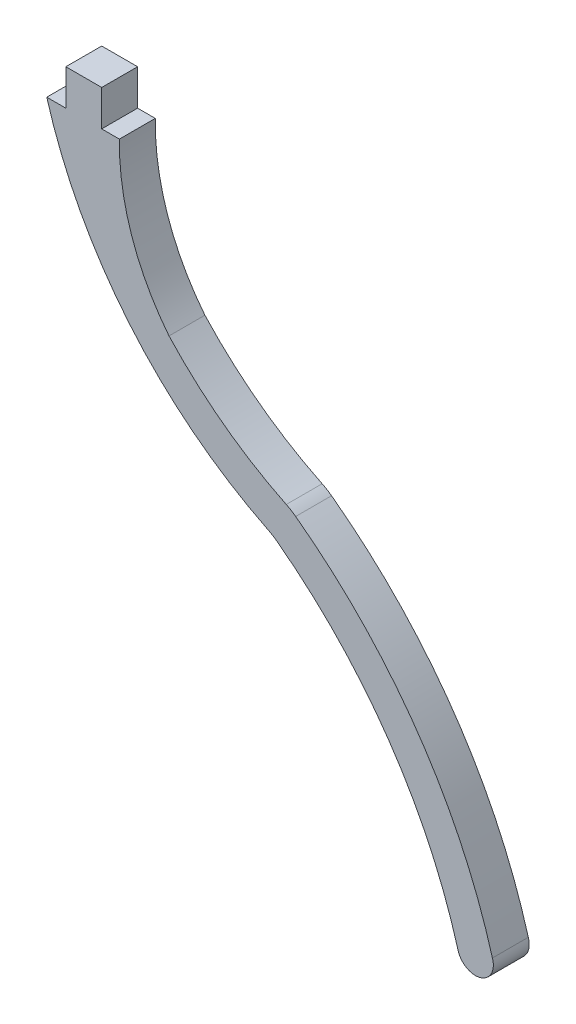
ISO-10303-21;
HEADER;
FILE_DESCRIPTION(('STEP AP214'),'2;1');
FILE_NAME('part.step','',(''),(''),'','','');
FILE_SCHEMA(('AUTOMOTIVE_DESIGN { 1 0 10303 214 1 1 1 1 }'));
ENDSEC;
DATA;
#1=APPLICATION_CONTEXT('core data for automotive mechanical design processes');
#2=APPLICATION_PROTOCOL_DEFINITION('international standard','automotive_design',2000,#1);
#3=PRODUCT_CONTEXT('',#1,'mechanical');
#4=PRODUCT('Part','Part','',(#3));
#5=PRODUCT_RELATED_PRODUCT_CATEGORY('part','',(#4));
#6=PRODUCT_DEFINITION_FORMATION('','',#4);
#7=PRODUCT_DEFINITION_CONTEXT('part definition',#1,'design');
#8=PRODUCT_DEFINITION('design','',#6,#7);
#9=PRODUCT_DEFINITION_SHAPE('','',#8);
#10=(LENGTH_UNIT() NAMED_UNIT(*) SI_UNIT(.MILLI.,.METRE.));
#11=(NAMED_UNIT(*) PLANE_ANGLE_UNIT() SI_UNIT($,.RADIAN.));
#12=(NAMED_UNIT(*) SI_UNIT($,.STERADIAN.) SOLID_ANGLE_UNIT());
#13=UNCERTAINTY_MEASURE_WITH_UNIT(LENGTH_MEASURE(1.E-05),#10,'distance_accuracy_value','');
#14=(GEOMETRIC_REPRESENTATION_CONTEXT(3) GLOBAL_UNCERTAINTY_ASSIGNED_CONTEXT((#13)) GLOBAL_UNIT_ASSIGNED_CONTEXT((#10,
#11,#12)) REPRESENTATION_CONTEXT('',''));
#15=CARTESIAN_POINT('',(0.,0.,0.));
#16=DIRECTION('',(0.,0.,1.));
#17=DIRECTION('',(1.,0.,0.));
#18=AXIS2_PLACEMENT_3D('',#15,#16,#17);
#19=CARTESIAN_POINT('',(11.455226844423,-12.1774036241141,1.524));
#20=DIRECTION('',(0.,0.,-1.));
#21=DIRECTION('',(-1.,0.,0.));
#22=AXIS2_PLACEMENT_3D('',#19,#20,#21);
#23=CYLINDRICAL_SURFACE('',#22,2.54);
#24=CARTESIAN_POINT('',(11.455226844423,-12.1774036241141,0.));
#25=DIRECTION('',(0.,0.,1.));
#26=DIRECTION('',(1.,0.,0.));
#27=AXIS2_PLACEMENT_3D('',#24,#25,#26);
#28=CIRCLE('',#27,2.54);
#29=CARTESIAN_POINT('',(12.5663048739761,-9.89330519973653,0.));
#30=VERTEX_POINT('',#29);
#31=CARTESIAN_POINT('',(12.9652019085972,-10.1349601596402,0.));
#32=VERTEX_POINT('',#31);
#33=EDGE_CURVE('E157',#30,#32,#28,.F.);
#34=ORIENTED_EDGE('',*,*,#33,.F.);
#35=DIRECTION('',(0.,0.,-1.));
#36=VECTOR('',#35,1.);
#37=CARTESIAN_POINT('',(12.5663048739761,-9.89330519973653,1.524));
#38=LINE('',#37,#36);
#39=CARTESIAN_POINT('',(12.5663048739761,-9.89330519973653,1.524));
#40=VERTEX_POINT('',#39);
#41=EDGE_CURVE('E11',#40,#30,#38,.T.);
#42=ORIENTED_EDGE('',*,*,#41,.F.);
#43=CARTESIAN_POINT('',(11.455226844423,-12.1774036241141,1.524));
#44=DIRECTION('',(0.,0.,1.));
#45=DIRECTION('',(1.,0.,0.));
#46=AXIS2_PLACEMENT_3D('',#43,#44,#45);
#47=CIRCLE('',#46,2.54);
#48=CARTESIAN_POINT('',(12.9652019085972,-10.1349601596402,1.524));
#49=VERTEX_POINT('',#48);
#50=EDGE_CURVE('E189',#40,#49,#47,.F.);
#51=ORIENTED_EDGE('',*,*,#50,.T.);
#52=DIRECTION('',(0.,0.,-1.));
#53=VECTOR('',#52,1.);
#54=CARTESIAN_POINT('',(12.9652019085972,-10.1349601596402,1.524));
#55=LINE('',#54,#53);
#56=EDGE_CURVE('E50',#49,#32,#55,.T.);
#57=ORIENTED_EDGE('',*,*,#56,.T.);
#58=EDGE_LOOP('',(#34,#42,#51,#57));
#59=FACE_BOUND('',#58,.T.);
#60=ADVANCED_FACE('F34',(#59),#23,.T.);
#61=CARTESIAN_POINT('',(19.8543390121188,5.08906943909652,1.524));
#62=DIRECTION('',(0.,0.,-1.));
#63=DIRECTION('',(-1.,0.,0.));
#64=AXIS2_PLACEMENT_3D('',#61,#62,#63);
#65=CYLINDRICAL_SURFACE('',#64,16.6609420927234);
#66=CARTESIAN_POINT('',(19.8543390121188,5.08906943909652,0.));
#67=DIRECTION('',(0.,0.,1.));
#68=DIRECTION('',(1.,0.,0.));
#69=AXIS2_PLACEMENT_3D('',#66,#67,#68);
#70=CIRCLE('',#69,16.6609420927234);
#71=CARTESIAN_POINT('',(7.58765753171491,-6.18548229812995,0.));
#72=VERTEX_POINT('',#71);
#73=EDGE_CURVE('E159',#72,#30,#70,.T.);
#74=ORIENTED_EDGE('',*,*,#73,.F.);
#75=DIRECTION('',(0.,0.,-1.));
#76=VECTOR('',#75,1.);
#77=CARTESIAN_POINT('',(7.58765753171491,-6.18548229812995,1.524));
#78=LINE('',#77,#76);
#79=CARTESIAN_POINT('',(7.58765753171491,-6.18548229812995,1.524));
#80=VERTEX_POINT('',#79);
#81=EDGE_CURVE('E42',#80,#72,#78,.T.);
#82=ORIENTED_EDGE('',*,*,#81,.F.);
#83=CARTESIAN_POINT('',(19.8543390121188,5.08906943909652,1.524));
#84=DIRECTION('',(0.,0.,1.));
#85=DIRECTION('',(1.,0.,0.));
#86=AXIS2_PLACEMENT_3D('',#83,#84,#85);
#87=CIRCLE('',#86,16.6609420927234);
#88=EDGE_CURVE('E230',#80,#40,#87,.T.);
#89=ORIENTED_EDGE('',*,*,#88,.T.);
#90=ORIENTED_EDGE('',*,*,#41,.T.);
#91=EDGE_LOOP('',(#74,#82,#89,#90));
#92=FACE_BOUND('',#91,.T.);
#93=ADVANCED_FACE('F218',(#92),#65,.F.);
#94=CARTESIAN_POINT('',(15.1604983598982,-0.153902537534086,1.524));
#95=DIRECTION('',(0.,0.,-1.));
#96=DIRECTION('',(-1.,0.,0.));
#97=AXIS2_PLACEMENT_3D('',#94,#95,#96);
#98=CYLINDRICAL_SURFACE('',#97,9.68131564496423);
#99=CARTESIAN_POINT('',(15.1604983598982,-0.153902537534086,0.));
#100=DIRECTION('',(0.,0.,1.));
#101=DIRECTION('',(1.,0.,0.));
#102=AXIS2_PLACEMENT_3D('',#99,#100,#101);
#103=CIRCLE('',#102,9.68131564496423);
#104=CARTESIAN_POINT('',(5.48040607591815,0.,0.));
#105=VERTEX_POINT('',#104);
#106=EDGE_CURVE('E162',#105,#72,#103,.T.);
#107=ORIENTED_EDGE('',*,*,#106,.F.);
#108=DIRECTION('',(0.,0.,-1.));
#109=VECTOR('',#108,1.);
#110=CARTESIAN_POINT('',(5.48040607591815,0.,1.524));
#111=LINE('',#110,#109);
#112=CARTESIAN_POINT('',(5.48040607591815,0.,1.524));
#113=VERTEX_POINT('',#112);
#114=EDGE_CURVE('E207',#113,#105,#111,.T.);
#115=ORIENTED_EDGE('',*,*,#114,.F.);
#116=CARTESIAN_POINT('',(15.1604983598982,-0.153902537534086,1.524));
#117=DIRECTION('',(0.,0.,1.));
#118=DIRECTION('',(1.,0.,0.));
#119=AXIS2_PLACEMENT_3D('',#116,#117,#118);
#120=CIRCLE('',#119,9.68131564496423);
#121=EDGE_CURVE('E214',#113,#80,#120,.T.);
#122=ORIENTED_EDGE('',*,*,#121,.T.);
#123=ORIENTED_EDGE('',*,*,#81,.T.);
#124=EDGE_LOOP('',(#107,#115,#122,#123));
#125=FACE_BOUND('',#124,.T.);
#126=ADVANCED_FACE('F212',(#125),#98,.F.);
#127=CARTESIAN_POINT('',(0.,0.,1.524));
#128=DIRECTION('',(0.,1.,0.));
#129=DIRECTION('',(-1.,0.,0.));
#130=AXIS2_PLACEMENT_3D('',#127,#128,#129);
#131=PLANE('',#130);
#132=DIRECTION('',(1.,0.,0.));
#133=VECTOR('',#132,1.);
#134=CARTESIAN_POINT('',(0.,0.,0.));
#135=LINE('',#134,#133);
#136=CARTESIAN_POINT('',(4.72954689049709,0.,0.));
#137=VERTEX_POINT('',#136);
#138=EDGE_CURVE('E165',#137,#105,#135,.T.);
#139=ORIENTED_EDGE('',*,*,#138,.F.);
#140=DIRECTION('',(0.,0.,-1.));
#141=VECTOR('',#140,1.);
#142=CARTESIAN_POINT('',(4.72954689049709,0.,1.524));
#143=LINE('',#142,#141);
#144=CARTESIAN_POINT('',(4.72954689049709,0.,1.524));
#145=VERTEX_POINT('',#144);
#146=EDGE_CURVE('E205',#145,#137,#143,.T.);
#147=ORIENTED_EDGE('',*,*,#146,.F.);
#148=DIRECTION('',(1.,0.,0.));
#149=VECTOR('',#148,1.);
#150=CARTESIAN_POINT('',(0.,0.,1.524));
#151=LINE('',#150,#149);
#152=EDGE_CURVE('E227',#145,#113,#151,.T.);
#153=ORIENTED_EDGE('',*,*,#152,.T.);
#154=ORIENTED_EDGE('',*,*,#114,.T.);
#155=EDGE_LOOP('',(#139,#147,#153,#154));
#156=FACE_BOUND('',#155,.T.);
#157=ADVANCED_FACE('F224',(#156),#131,.T.);
#158=CARTESIAN_POINT('',(4.72954689049709,0.,1.524));
#159=DIRECTION('',(1.,0.,0.));
#160=DIRECTION('',(0.,0.,-1.));
#161=AXIS2_PLACEMENT_3D('',#158,#159,#160);
#162=PLANE('',#161);
#163=DIRECTION('',(0.,-1.,0.));
#164=VECTOR('',#163,1.);
#165=CARTESIAN_POINT('',(4.72954689049709,0.,0.));
#166=LINE('',#165,#164);
#167=CARTESIAN_POINT('',(4.72954689049709,1.52399999999999,0.));
#168=VERTEX_POINT('',#167);
#169=EDGE_CURVE('E168',#168,#137,#166,.T.);
#170=ORIENTED_EDGE('',*,*,#169,.F.);
#171=DIRECTION('',(0.,0.,-1.));
#172=VECTOR('',#171,1.);
#173=CARTESIAN_POINT('',(4.72954689049709,1.52399999999999,1.524));
#174=LINE('',#173,#172);
#175=CARTESIAN_POINT('',(4.72954689049709,1.52399999999999,1.524));
#176=VERTEX_POINT('',#175);
#177=EDGE_CURVE('E203',#176,#168,#174,.T.);
#178=ORIENTED_EDGE('',*,*,#177,.F.);
#179=DIRECTION('',(0.,-1.,0.));
#180=VECTOR('',#179,1.);
#181=CARTESIAN_POINT('',(4.72954689049709,0.,1.524));
#182=LINE('',#181,#180);
#183=EDGE_CURVE('E232',#176,#145,#182,.T.);
#184=ORIENTED_EDGE('',*,*,#183,.T.);
#185=ORIENTED_EDGE('',*,*,#146,.T.);
#186=EDGE_LOOP('',(#170,#178,#184,#185));
#187=FACE_BOUND('',#186,.T.);
#188=ADVANCED_FACE('F279',(#187),#162,.T.);
#189=CARTESIAN_POINT('',(0.,1.52399999999999,1.524));
#190=DIRECTION('',(0.,1.,0.));
#191=DIRECTION('',(0.,0.,1.));
#192=AXIS2_PLACEMENT_3D('',#189,#190,#191);
#193=PLANE('',#192);
#194=DIRECTION('',(1.,0.,0.));
#195=VECTOR('',#194,1.);
#196=CARTESIAN_POINT('',(0.,1.52399999999999,0.));
#197=LINE('',#196,#195);
#198=CARTESIAN_POINT('',(3.20554689049709,1.52399999999999,0.));
#199=VERTEX_POINT('',#198);
#200=EDGE_CURVE('E171',#199,#168,#197,.T.);
#201=ORIENTED_EDGE('',*,*,#200,.F.);
#202=DIRECTION('',(0.,0.,-1.));
#203=VECTOR('',#202,1.);
#204=CARTESIAN_POINT('',(3.20554689049709,1.52399999999999,1.524));
#205=LINE('',#204,#203);
#206=CARTESIAN_POINT('',(3.20554689049709,1.52399999999999,1.524));
#207=VERTEX_POINT('',#206);
#208=EDGE_CURVE('E201',#207,#199,#205,.T.);
#209=ORIENTED_EDGE('',*,*,#208,.F.);
#210=DIRECTION('',(1.,0.,0.));
#211=VECTOR('',#210,1.);
#212=CARTESIAN_POINT('',(0.,1.52399999999999,1.524));
#213=LINE('',#212,#211);
#214=EDGE_CURVE('E238',#207,#176,#213,.T.);
#215=ORIENTED_EDGE('',*,*,#214,.T.);
#216=ORIENTED_EDGE('',*,*,#177,.T.);
#217=EDGE_LOOP('',(#201,#209,#215,#216));
#218=FACE_BOUND('',#217,.T.);
#219=ADVANCED_FACE('F282',(#218),#193,.T.);
#220=CARTESIAN_POINT('',(3.20554689049709,0.,1.524));
#221=DIRECTION('',(-1.,0.,0.));
#222=DIRECTION('',(0.,0.,1.));
#223=AXIS2_PLACEMENT_3D('',#220,#221,#222);
#224=PLANE('',#223);
#225=DIRECTION('',(0.,1.,0.));
#226=VECTOR('',#225,1.);
#227=CARTESIAN_POINT('',(3.20554689049709,0.,0.));
#228=LINE('',#227,#226);
#229=CARTESIAN_POINT('',(3.20554689049709,0.,0.));
#230=VERTEX_POINT('',#229);
#231=EDGE_CURVE('E174',#230,#199,#228,.T.);
#232=ORIENTED_EDGE('',*,*,#231,.F.);
#233=DIRECTION('',(0.,0.,-1.));
#234=VECTOR('',#233,1.);
#235=CARTESIAN_POINT('',(3.20554689049709,0.,1.524));
#236=LINE('',#235,#234);
#237=CARTESIAN_POINT('',(3.20554689049709,0.,1.524));
#238=VERTEX_POINT('',#237);
#239=EDGE_CURVE('E199',#238,#230,#236,.T.);
#240=ORIENTED_EDGE('',*,*,#239,.F.);
#241=DIRECTION('',(0.,1.,0.));
#242=VECTOR('',#241,1.);
#243=CARTESIAN_POINT('',(3.20554689049709,0.,1.524));
#244=LINE('',#243,#242);
#245=EDGE_CURVE('E241',#238,#207,#244,.T.);
#246=ORIENTED_EDGE('',*,*,#245,.T.);
#247=ORIENTED_EDGE('',*,*,#208,.T.);
#248=EDGE_LOOP('',(#232,#240,#246,#247));
#249=FACE_BOUND('',#248,.T.);
#250=ADVANCED_FACE('F286',(#249),#224,.T.);
#251=CARTESIAN_POINT('',(0.,0.,1.524));
#252=DIRECTION('',(0.,-1.,0.));
#253=DIRECTION('',(1.,0.,0.));
#254=AXIS2_PLACEMENT_3D('',#251,#252,#253);
#255=PLANE('',#254);
#256=DIRECTION('',(-1.,0.,0.));
#257=VECTOR('',#256,1.);
#258=CARTESIAN_POINT('',(0.,0.,0.));
#259=LINE('',#258,#257);
#260=CARTESIAN_POINT('',(2.39600314755961,0.,0.));
#261=VERTEX_POINT('',#260);
#262=EDGE_CURVE('E177',#230,#261,#259,.T.);
#263=ORIENTED_EDGE('',*,*,#262,.T.);
#264=DIRECTION('',(0.,0.,-1.));
#265=VECTOR('',#264,1.);
#266=CARTESIAN_POINT('',(2.39600314755961,0.,1.524));
#267=LINE('',#266,#265);
#268=CARTESIAN_POINT('',(2.39600314755961,0.,1.524));
#269=VERTEX_POINT('',#268);
#270=EDGE_CURVE('E196',#269,#261,#267,.T.);
#271=ORIENTED_EDGE('',*,*,#270,.F.);
#272=DIRECTION('',(-1.,0.,0.));
#273=VECTOR('',#272,1.);
#274=CARTESIAN_POINT('',(0.,0.,1.524));
#275=LINE('',#274,#273);
#276=EDGE_CURVE('E244',#238,#269,#275,.T.);
#277=ORIENTED_EDGE('',*,*,#276,.F.);
#278=ORIENTED_EDGE('',*,*,#239,.T.);
#279=EDGE_LOOP('',(#263,#271,#277,#278));
#280=FACE_BOUND('',#279,.T.);
#281=ADVANCED_FACE('F290',(#280),#255,.F.);
#282=CARTESIAN_POINT('',(19.8543390121188,5.08906943909652,1.524));
#283=DIRECTION('',(0.,0.,-1.));
#284=DIRECTION('',(-1.,0.,0.));
#285=AXIS2_PLACEMENT_3D('',#282,#283,#284);
#286=CYLINDRICAL_SURFACE('',#285,18.1849420927234);
#287=CARTESIAN_POINT('',(19.8543390121188,5.08906943909652,0.));
#288=DIRECTION('',(0.,0.,1.));
#289=DIRECTION('',(1.,0.,0.));
#290=AXIS2_PLACEMENT_3D('',#287,#288,#289);
#291=CIRCLE('',#290,18.1849420927234);
#292=CARTESIAN_POINT('',(11.7847006981072,-11.2073429389926,0.));
#293=VERTEX_POINT('',#292);
#294=EDGE_CURVE('E179',#261,#293,#291,.T.);
#295=ORIENTED_EDGE('',*,*,#294,.T.);
#296=DIRECTION('',(0.,0.,-1.));
#297=VECTOR('',#296,1.);
#298=CARTESIAN_POINT('',(11.7847006981072,-11.2073429389926,1.524));
#299=LINE('',#298,#297);
#300=CARTESIAN_POINT('',(11.7847006981072,-11.2073429389926,1.524));
#301=VERTEX_POINT('',#300);
#302=EDGE_CURVE('E193',#301,#293,#299,.T.);
#303=ORIENTED_EDGE('',*,*,#302,.F.);
#304=CARTESIAN_POINT('',(19.8543390121188,5.08906943909652,1.524));
#305=DIRECTION('',(0.,0.,1.));
#306=DIRECTION('',(1.,0.,0.));
#307=AXIS2_PLACEMENT_3D('',#304,#305,#306);
#308=CIRCLE('',#307,18.1849420927234);
#309=EDGE_CURVE('E246',#269,#301,#308,.T.);
#310=ORIENTED_EDGE('',*,*,#309,.F.);
#311=ORIENTED_EDGE('',*,*,#270,.T.);
#312=EDGE_LOOP('',(#295,#303,#310,#311));
#313=FACE_BOUND('',#312,.T.);
#314=ADVANCED_FACE('F253',(#313),#286,.T.);
#315=CARTESIAN_POINT('',(10.6575658844203,-13.4835606596369,1.524));
#316=DIRECTION('',(0.,0.,-1.));
#317=DIRECTION('',(-1.,0.,0.));
#318=AXIS2_PLACEMENT_3D('',#315,#316,#317);
#319=CYLINDRICAL_SURFACE('',#318,2.54);
#320=CARTESIAN_POINT('',(10.6575658844203,-13.4835606596369,0.));
#321=DIRECTION('',(0.,0.,1.));
#322=DIRECTION('',(1.,0.,0.));
#323=AXIS2_PLACEMENT_3D('',#320,#321,#322);
#324=CIRCLE('',#323,2.54);
#325=CARTESIAN_POINT('',(12.1822657890628,-11.4520857765081,0.));
#326=VERTEX_POINT('',#325);
#327=EDGE_CURVE('E181',#293,#326,#324,.F.);
#328=ORIENTED_EDGE('',*,*,#327,.T.);
#329=DIRECTION('',(0.,0.,-1.));
#330=VECTOR('',#329,1.);
#331=CARTESIAN_POINT('',(12.1822657890628,-11.4520857765081,1.524));
#332=LINE('',#331,#330);
#333=CARTESIAN_POINT('',(12.1822657890628,-11.4520857765081,1.524));
#334=VERTEX_POINT('',#333);
#335=EDGE_CURVE('E149',#334,#326,#332,.T.);
#336=ORIENTED_EDGE('',*,*,#335,.F.);
#337=CARTESIAN_POINT('',(10.6575658844203,-13.4835606596369,1.524));
#338=DIRECTION('',(0.,0.,1.));
#339=DIRECTION('',(1.,0.,0.));
#340=AXIS2_PLACEMENT_3D('',#337,#338,#339);
#341=CIRCLE('',#340,2.54);
#342=EDGE_CURVE('E137',#301,#334,#341,.F.);
#343=ORIENTED_EDGE('',*,*,#342,.F.);
#344=ORIENTED_EDGE('',*,*,#302,.T.);
#345=EDGE_LOOP('',(#328,#336,#343,#344));
#346=FACE_BOUND('',#345,.T.);
#347=ADVANCED_FACE('F257',(#346),#319,.F.);
#348=CARTESIAN_POINT('',(-0.558970723708179,-28.4282145720071,1.524));
#349=DIRECTION('',(0.,0.,-1.));
#350=DIRECTION('',(-1.,0.,0.));
#351=AXIS2_PLACEMENT_3D('',#348,#349,#350);
#352=CYLINDRICAL_SURFACE('',#351,21.2256462034902);
#353=CARTESIAN_POINT('',(-0.558970723708179,-28.4282145720071,0.));
#354=DIRECTION('',(0.,0.,1.));
#355=DIRECTION('',(1.,0.,0.));
#356=AXIS2_PLACEMENT_3D('',#353,#354,#355);
#357=CIRCLE('',#356,21.2256462034902);
#358=CARTESIAN_POINT('',(19.8543390121188,-22.6123017128828,0.));
#359=VERTEX_POINT('',#358);
#360=EDGE_CURVE('E146',#326,#359,#357,.F.);
#361=ORIENTED_EDGE('',*,*,#360,.T.);
#362=DIRECTION('',(0.,0.,-1.));
#363=VECTOR('',#362,1.);
#364=CARTESIAN_POINT('',(19.8543390121188,-22.6123017128828,1.524));
#365=LINE('',#364,#363);
#366=CARTESIAN_POINT('',(19.8543390121188,-22.6123017128828,1.524));
#367=VERTEX_POINT('',#366);
#368=EDGE_CURVE('E143',#367,#359,#365,.T.);
#369=ORIENTED_EDGE('',*,*,#368,.F.);
#370=CARTESIAN_POINT('',(-0.558970723708179,-28.4282145720071,1.524));
#371=DIRECTION('',(0.,0.,1.));
#372=DIRECTION('',(1.,0.,0.));
#373=AXIS2_PLACEMENT_3D('',#370,#371,#372);
#374=CIRCLE('',#373,21.2256462034902);
#375=EDGE_CURVE('E130',#334,#367,#374,.F.);
#376=ORIENTED_EDGE('',*,*,#375,.F.);
#377=ORIENTED_EDGE('',*,*,#335,.T.);
#378=EDGE_LOOP('',(#361,#369,#376,#377));
#379=FACE_BOUND('',#378,.T.);
#380=ADVANCED_FACE('F144',(#379),#352,.F.);
#381=CARTESIAN_POINT('',(20.5975354347785,-22.4398707186363,1.524));
#382=DIRECTION('',(0.,0.,-1.));
#383=DIRECTION('',(-1.,0.,0.));
#384=AXIS2_PLACEMENT_3D('',#381,#382,#383);
#385=CYLINDRICAL_SURFACE('',#384,0.762937330605154);
#386=CARTESIAN_POINT('',(20.5975354347785,-22.4398707186363,0.));
#387=DIRECTION('',(0.,0.,1.));
#388=DIRECTION('',(1.,0.,0.));
#389=AXIS2_PLACEMENT_3D('',#386,#387,#388);
#390=CIRCLE('',#389,0.762937330605154);
#391=CARTESIAN_POINT('',(21.3200133072216,-22.1947195524938,0.));
#392=VERTEX_POINT('',#391);
#393=EDGE_CURVE('E184',#392,#359,#390,.F.);
#394=ORIENTED_EDGE('',*,*,#393,.F.);
#395=DIRECTION('',(0.,0.,-1.));
#396=VECTOR('',#395,1.);
#397=CARTESIAN_POINT('',(21.3200133072216,-22.1947195524938,1.524));
#398=LINE('',#397,#396);
#399=CARTESIAN_POINT('',(21.3200133072216,-22.1947195524938,1.524));
#400=VERTEX_POINT('',#399);
#401=EDGE_CURVE('E90',#400,#392,#398,.T.);
#402=ORIENTED_EDGE('',*,*,#401,.F.);
#403=CARTESIAN_POINT('',(20.5975354347785,-22.4398707186363,1.524));
#404=DIRECTION('',(0.,0.,1.));
#405=DIRECTION('',(1.,0.,0.));
#406=AXIS2_PLACEMENT_3D('',#403,#404,#405);
#407=CIRCLE('',#406,0.762937330605154);
#408=EDGE_CURVE('E135',#400,#367,#407,.F.);
#409=ORIENTED_EDGE('',*,*,#408,.T.);
#410=ORIENTED_EDGE('',*,*,#368,.T.);
#411=EDGE_LOOP('',(#394,#402,#409,#410));
#412=FACE_BOUND('',#411,.T.);
#413=ADVANCED_FACE('F151',(#412),#385,.T.);
#414=CARTESIAN_POINT('',(-0.558970723708179,-28.4282145720071,1.524));
#415=DIRECTION('',(0.,0.,-1.));
#416=DIRECTION('',(-1.,0.,0.));
#417=AXIS2_PLACEMENT_3D('',#414,#415,#416);
#418=CYLINDRICAL_SURFACE('',#417,22.7496462034902);
#419=CARTESIAN_POINT('',(-0.558970723708179,-28.4282145720071,0.));
#420=DIRECTION('',(0.,0.,1.));
#421=DIRECTION('',(1.,0.,0.));
#422=AXIS2_PLACEMENT_3D('',#419,#420,#421);
#423=CIRCLE('',#422,22.7496462034902);
#424=EDGE_CURVE('E186',#32,#392,#423,.F.);
#425=ORIENTED_EDGE('',*,*,#424,.F.);
#426=ORIENTED_EDGE('',*,*,#56,.F.);
#427=CARTESIAN_POINT('',(-0.558970723708179,-28.4282145720071,1.524));
#428=DIRECTION('',(0.,0.,1.));
#429=DIRECTION('',(1.,0.,0.));
#430=AXIS2_PLACEMENT_3D('',#427,#428,#429);
#431=CIRCLE('',#430,22.7496462034902);
#432=EDGE_CURVE('E152',#49,#400,#431,.F.);
#433=ORIENTED_EDGE('',*,*,#432,.T.);
#434=ORIENTED_EDGE('',*,*,#401,.T.);
#435=EDGE_LOOP('',(#425,#426,#433,#434));
#436=FACE_BOUND('',#435,.T.);
#437=ADVANCED_FACE('F258',(#436),#418,.T.);
#438=CARTESIAN_POINT('',(0.,0.,1.524));
#439=DIRECTION('',(0.,0.,1.));
#440=DIRECTION('',(1.,0.,0.));
#441=AXIS2_PLACEMENT_3D('',#438,#439,#440);
#442=PLANE('',#441);
#443=ORIENTED_EDGE('',*,*,#50,.F.);
#444=ORIENTED_EDGE('',*,*,#88,.F.);
#445=ORIENTED_EDGE('',*,*,#121,.F.);
#446=ORIENTED_EDGE('',*,*,#152,.F.);
#447=ORIENTED_EDGE('',*,*,#183,.F.);
#448=ORIENTED_EDGE('',*,*,#214,.F.);
#449=ORIENTED_EDGE('',*,*,#245,.F.);
#450=ORIENTED_EDGE('',*,*,#276,.T.);
#451=ORIENTED_EDGE('',*,*,#309,.T.);
#452=ORIENTED_EDGE('',*,*,#342,.T.);
#453=ORIENTED_EDGE('',*,*,#375,.T.);
#454=ORIENTED_EDGE('',*,*,#408,.F.);
#455=ORIENTED_EDGE('',*,*,#432,.F.);
#456=EDGE_LOOP('',(#443,#444,#445,#446,#447,#448,#449,#450,#451,#452,#453,#454,#455));
#457=FACE_BOUND('',#456,.T.);
#458=ADVANCED_FACE('F132',(#457),#442,.T.);
#459=CARTESIAN_POINT('',(0.,0.,0.));
#460=DIRECTION('',(0.,0.,1.));
#461=DIRECTION('',(1.,0.,0.));
#462=AXIS2_PLACEMENT_3D('',#459,#460,#461);
#463=PLANE('',#462);
#464=ORIENTED_EDGE('',*,*,#33,.T.);
#465=ORIENTED_EDGE('',*,*,#424,.T.);
#466=ORIENTED_EDGE('',*,*,#393,.T.);
#467=ORIENTED_EDGE('',*,*,#360,.F.);
#468=ORIENTED_EDGE('',*,*,#327,.F.);
#469=ORIENTED_EDGE('',*,*,#294,.F.);
#470=ORIENTED_EDGE('',*,*,#262,.F.);
#471=ORIENTED_EDGE('',*,*,#231,.T.);
#472=ORIENTED_EDGE('',*,*,#200,.T.);
#473=ORIENTED_EDGE('',*,*,#169,.T.);
#474=ORIENTED_EDGE('',*,*,#138,.T.);
#475=ORIENTED_EDGE('',*,*,#106,.T.);
#476=ORIENTED_EDGE('',*,*,#73,.T.);
#477=EDGE_LOOP('',(#464,#465,#466,#467,#468,#469,#470,#471,#472,#473,#474,#475,#476));
#478=FACE_BOUND('',#477,.T.);
#479=ADVANCED_FACE('F220',(#478),#463,.F.);
#480=CLOSED_SHELL('',(#60,#93,#126,#157,#188,#219,#250,#281,#314,#347,#380,#413,#437,#458,#479));
#481=MANIFOLD_SOLID_BREP('B2',#480);
#482=ADVANCED_BREP_SHAPE_REPRESENTATION('',(#18,#481),#14);
#483=SHAPE_DEFINITION_REPRESENTATION(#9,#482);
ENDSEC;
END-ISO-10303-21;
